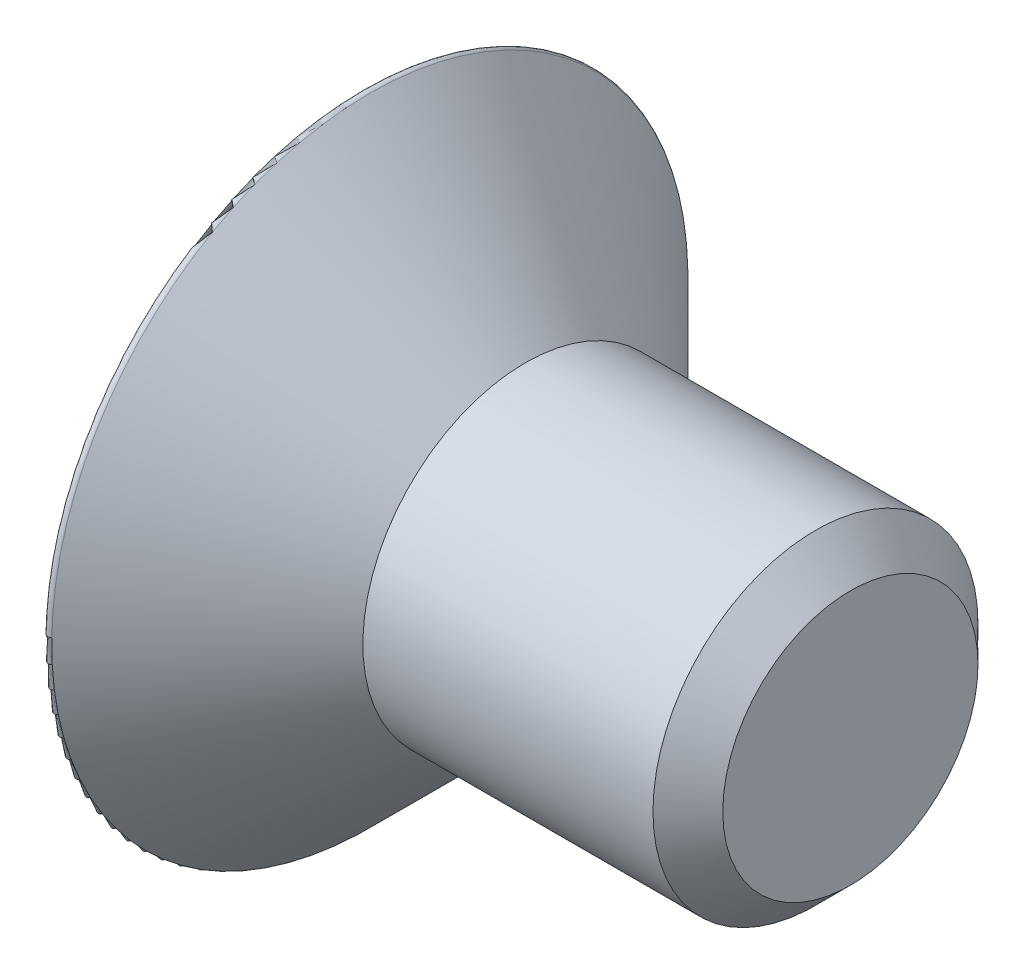
ISO-10303-21;
HEADER;
FILE_DESCRIPTION(('STEP AP214'),'2;1');
FILE_NAME('part.step','',(''),(''),'','','');
FILE_SCHEMA(('AUTOMOTIVE_DESIGN { 1 0 10303 214 1 1 1 1 }'));
ENDSEC;
DATA;
#1=APPLICATION_CONTEXT('core data for automotive mechanical design processes');
#2=APPLICATION_PROTOCOL_DEFINITION('international standard','automotive_design',2000,#1);
#3=PRODUCT_CONTEXT('',#1,'mechanical');
#4=PRODUCT('Part','Part','',(#3));
#5=PRODUCT_RELATED_PRODUCT_CATEGORY('part','',(#4));
#6=PRODUCT_DEFINITION_FORMATION('','',#4);
#7=PRODUCT_DEFINITION_CONTEXT('part definition',#1,'design');
#8=PRODUCT_DEFINITION('design','',#6,#7);
#9=PRODUCT_DEFINITION_SHAPE('','',#8);
#10=(LENGTH_UNIT() NAMED_UNIT(*) SI_UNIT(.MILLI.,.METRE.));
#11=(NAMED_UNIT(*) PLANE_ANGLE_UNIT() SI_UNIT($,.RADIAN.));
#12=(NAMED_UNIT(*) SI_UNIT($,.STERADIAN.) SOLID_ANGLE_UNIT());
#13=UNCERTAINTY_MEASURE_WITH_UNIT(LENGTH_MEASURE(1.E-05),#10,'distance_accuracy_value','');
#14=(GEOMETRIC_REPRESENTATION_CONTEXT(3) GLOBAL_UNCERTAINTY_ASSIGNED_CONTEXT((#13)) GLOBAL_UNIT_ASSIGNED_CONTEXT((#10,
#11,#12)) REPRESENTATION_CONTEXT('',''));
#15=CARTESIAN_POINT('',(0.,0.,0.));
#16=DIRECTION('',(0.,0.,1.));
#17=DIRECTION('',(1.,0.,0.));
#18=AXIS2_PLACEMENT_3D('',#15,#16,#17);
#19=CARTESIAN_POINT('',(1.15,0.,0.));
#20=DIRECTION('',(1.,0.,0.));
#21=DIRECTION('',(0.,0.,-1.));
#22=AXIS2_PLACEMENT_3D('',#19,#20,#21);
#23=PLANE('',#22);
#24=DIRECTION('',(0.,1.,0.));
#25=VECTOR('',#24,1.);
#26=CARTESIAN_POINT('',(1.15,0.72168783648703,1.25));
#27=LINE('',#26,#25);
#28=CARTESIAN_POINT('',(1.15,-0.72168783648703,1.25));
#29=VERTEX_POINT('',#28);
#30=CARTESIAN_POINT('',(1.15,0.72168783648703,1.25));
#31=VERTEX_POINT('',#30);
#32=EDGE_CURVE('E74',#29,#31,#27,.T.);
#33=ORIENTED_EDGE('',*,*,#32,.T.);
#34=DIRECTION('',(0.,-0.50000000000002,0.866025403784427));
#35=VECTOR('',#34,1.);
#36=CARTESIAN_POINT('',(1.15,1.4433756729741,0.));
#37=LINE('',#36,#35);
#38=CARTESIAN_POINT('',(1.15,1.4433756729741,0.));
#39=VERTEX_POINT('',#38);
#40=EDGE_CURVE('E105',#31,#39,#37,.F.);
#41=ORIENTED_EDGE('',*,*,#40,.T.);
#42=DIRECTION('',(0.,0.50000000000002,0.866025403784427));
#43=VECTOR('',#42,1.);
#44=CARTESIAN_POINT('',(1.15,0.72168783648703,-1.25));
#45=LINE('',#44,#43);
#46=CARTESIAN_POINT('',(1.15,0.72168783648703,-1.25));
#47=VERTEX_POINT('',#46);
#48=EDGE_CURVE('E100',#39,#47,#45,.F.);
#49=ORIENTED_EDGE('',*,*,#48,.T.);
#50=DIRECTION('',(0.,1.,0.));
#51=VECTOR('',#50,1.);
#52=CARTESIAN_POINT('',(1.15,-0.72168783648703,-1.25));
#53=LINE('',#52,#51);
#54=CARTESIAN_POINT('',(1.15,-0.72168783648703,-1.25));
#55=VERTEX_POINT('',#54);
#56=EDGE_CURVE('E96',#47,#55,#53,.F.);
#57=ORIENTED_EDGE('',*,*,#56,.T.);
#58=DIRECTION('',(0.,0.50000000000002,-0.866025403784427));
#59=VECTOR('',#58,1.);
#60=CARTESIAN_POINT('',(1.15,-1.4433756729741,0.));
#61=LINE('',#60,#59);
#62=CARTESIAN_POINT('',(1.15,-1.4433756729741,0.));
#63=VERTEX_POINT('',#62);
#64=EDGE_CURVE('E70',#55,#63,#61,.F.);
#65=ORIENTED_EDGE('',*,*,#64,.T.);
#66=DIRECTION('',(0.,-0.50000000000002,-0.866025403784427));
#67=VECTOR('',#66,1.);
#68=CARTESIAN_POINT('',(1.15,-0.72168783648703,1.25));
#69=LINE('',#68,#67);
#70=EDGE_CURVE('E72',#63,#29,#69,.F.);
#71=ORIENTED_EDGE('',*,*,#70,.T.);
#72=EDGE_LOOP('',(#33,#41,#49,#57,#65,#71));
#73=FACE_BOUND('',#72,.T.);
#74=ADVANCED_FACE('F19',(#73),#23,.F.);
#75=CARTESIAN_POINT('',(6.,0.,0.));
#76=DIRECTION('',(1.,0.,0.));
#77=DIRECTION('',(0.,0.,-1.));
#78=AXIS2_PLACEMENT_3D('',#75,#76,#77);
#79=PLANE('',#78);
#80=CARTESIAN_POINT('',(5.99999999991496,0.,0.));
#81=DIRECTION('',(-1.,0.,0.));
#82=DIRECTION('',(0.,0.,1.));
#83=AXIS2_PLACEMENT_3D('',#80,#81,#82);
#84=CIRCLE('',#83,1.57050000001391);
#85=CARTESIAN_POINT('',(5.99999999991496,0.,1.57050000001391));
#86=VERTEX_POINT('',#85);
#87=EDGE_CURVE('E22',#86,#86,#84,.T.);
#88=ORIENTED_EDGE('',*,*,#87,.F.);
#89=EDGE_LOOP('',(#88));
#90=FACE_BOUND('',#89,.T.);
#91=ADVANCED_FACE('F177',(#90),#79,.T.);
#92=CARTESIAN_POINT('',(0.,0.72168783648703,1.25));
#93=DIRECTION('',(0.,0.,1.));
#94=DIRECTION('',(1.,0.,0.));
#95=AXIS2_PLACEMENT_3D('',#92,#93,#94);
#96=PLANE('',#95);
#97=DIRECTION('',(1.,0.,0.));
#98=VECTOR('',#97,1.);
#99=CARTESIAN_POINT('',(0.,0.721687836487029,1.25));
#100=LINE('',#99,#98);
#101=CARTESIAN_POINT('',(0.,0.72168783648703,1.25));
#102=VERTEX_POINT('',#101);
#103=EDGE_CURVE('E85',#102,#31,#100,.T.);
#104=ORIENTED_EDGE('',*,*,#103,.T.);
#105=ORIENTED_EDGE('',*,*,#32,.F.);
#106=DIRECTION('',(1.,0.,0.));
#107=VECTOR('',#106,1.);
#108=CARTESIAN_POINT('',(0.,-0.72168783648703,1.25));
#109=LINE('',#108,#107);
#110=CARTESIAN_POINT('',(0.,-0.72168783648703,1.25));
#111=VERTEX_POINT('',#110);
#112=EDGE_CURVE('E79',#29,#111,#109,.F.);
#113=ORIENTED_EDGE('',*,*,#112,.T.);
#114=DIRECTION('',(0.,1.,0.));
#115=VECTOR('',#114,1.);
#116=CARTESIAN_POINT('',(0.,4.,1.25));
#117=LINE('',#116,#115);
#118=EDGE_CURVE('E198',#102,#111,#117,.F.);
#119=ORIENTED_EDGE('',*,*,#118,.F.);
#120=EDGE_LOOP('',(#104,#105,#113,#119));
#121=FACE_BOUND('',#120,.T.);
#122=ADVANCED_FACE('F82',(#121),#96,.F.);
#123=CARTESIAN_POINT('',(0.,-0.72168783648703,1.25));
#124=DIRECTION('',(0.,-0.866025403784427,0.50000000000002));
#125=DIRECTION('',(0.,-0.50000000000002,-0.866025403784427));
#126=AXIS2_PLACEMENT_3D('',#123,#124,#125);
#127=PLANE('',#126);
#128=ORIENTED_EDGE('',*,*,#112,.F.);
#129=ORIENTED_EDGE('',*,*,#70,.F.);
#130=DIRECTION('',(1.,0.,0.));
#131=VECTOR('',#130,1.);
#132=CARTESIAN_POINT('',(0.,-1.4433756729741,0.));
#133=LINE('',#132,#131);
#134=CARTESIAN_POINT('',(0.,-1.4433756729741,0.));
#135=VERTEX_POINT('',#134);
#136=EDGE_CURVE('E92',#63,#135,#133,.F.);
#137=ORIENTED_EDGE('',*,*,#136,.T.);
#138=DIRECTION('',(0.,-0.50000000000002,-0.866025403784427));
#139=VECTOR('',#138,1.);
#140=CARTESIAN_POINT('',(0.,-0.72168783648703,1.25));
#141=LINE('',#140,#139);
#142=EDGE_CURVE('E89',#111,#135,#141,.T.);
#143=ORIENTED_EDGE('',*,*,#142,.F.);
#144=EDGE_LOOP('',(#128,#129,#137,#143));
#145=FACE_BOUND('',#144,.T.);
#146=ADVANCED_FACE('F87',(#145),#127,.F.);
#147=CARTESIAN_POINT('',(0.,-1.4433756729741,0.));
#148=DIRECTION('',(0.,-0.866025403784427,-0.50000000000002));
#149=DIRECTION('',(0.,0.50000000000002,-0.866025403784427));
#150=AXIS2_PLACEMENT_3D('',#147,#148,#149);
#151=PLANE('',#150);
#152=ORIENTED_EDGE('',*,*,#136,.F.);
#153=ORIENTED_EDGE('',*,*,#64,.F.);
#154=DIRECTION('',(-1.,0.,0.));
#155=VECTOR('',#154,1.);
#156=CARTESIAN_POINT('',(0.,-0.72168783648703,-1.25));
#157=LINE('',#156,#155);
#158=CARTESIAN_POINT('',(0.,-0.72168783648703,-1.25));
#159=VERTEX_POINT('',#158);
#160=EDGE_CURVE('E98',#55,#159,#157,.T.);
#161=ORIENTED_EDGE('',*,*,#160,.T.);
#162=DIRECTION('',(0.,0.50000000000002,-0.866025403784427));
#163=VECTOR('',#162,1.);
#164=CARTESIAN_POINT('',(0.,-1.4433756729741,0.));
#165=LINE('',#164,#163);
#166=EDGE_CURVE('E200',#135,#159,#165,.T.);
#167=ORIENTED_EDGE('',*,*,#166,.F.);
#168=EDGE_LOOP('',(#152,#153,#161,#167));
#169=FACE_BOUND('',#168,.T.);
#170=ADVANCED_FACE('F169',(#169),#151,.F.);
#171=CARTESIAN_POINT('',(0.,-0.72168783648703,-1.25));
#172=DIRECTION('',(0.,0.,-1.));
#173=DIRECTION('',(-1.,0.,0.));
#174=AXIS2_PLACEMENT_3D('',#171,#172,#173);
#175=PLANE('',#174);
#176=ORIENTED_EDGE('',*,*,#160,.F.);
#177=ORIENTED_EDGE('',*,*,#56,.F.);
#178=DIRECTION('',(1.,0.,0.));
#179=VECTOR('',#178,1.);
#180=CARTESIAN_POINT('',(0.,0.72168783648703,-1.25));
#181=LINE('',#180,#179);
#182=CARTESIAN_POINT('',(0.,0.72168783648703,-1.25));
#183=VERTEX_POINT('',#182);
#184=EDGE_CURVE('E102',#47,#183,#181,.F.);
#185=ORIENTED_EDGE('',*,*,#184,.T.);
#186=DIRECTION('',(0.,1.,0.));
#187=VECTOR('',#186,1.);
#188=CARTESIAN_POINT('',(0.,4.,-1.25));
#189=LINE('',#188,#187);
#190=EDGE_CURVE('E205',#159,#183,#189,.T.);
#191=ORIENTED_EDGE('',*,*,#190,.F.);
#192=EDGE_LOOP('',(#176,#177,#185,#191));
#193=FACE_BOUND('',#192,.T.);
#194=ADVANCED_FACE('F166',(#193),#175,.F.);
#195=CARTESIAN_POINT('',(0.,0.72168783648703,-1.25));
#196=DIRECTION('',(0.,0.866025403784427,-0.50000000000002));
#197=DIRECTION('',(0.,0.50000000000002,0.866025403784427));
#198=AXIS2_PLACEMENT_3D('',#195,#196,#197);
#199=PLANE('',#198);
#200=ORIENTED_EDGE('',*,*,#184,.F.);
#201=ORIENTED_EDGE('',*,*,#48,.F.);
#202=DIRECTION('',(1.,0.,0.));
#203=VECTOR('',#202,1.);
#204=CARTESIAN_POINT('',(0.,1.4433756729741,0.));
#205=LINE('',#204,#203);
#206=CARTESIAN_POINT('',(0.,1.4433756729741,0.));
#207=VERTEX_POINT('',#206);
#208=EDGE_CURVE('E37',#39,#207,#205,.F.);
#209=ORIENTED_EDGE('',*,*,#208,.T.);
#210=DIRECTION('',(0.,0.50000000000002,0.866025403784427));
#211=VECTOR('',#210,1.);
#212=CARTESIAN_POINT('',(0.,0.72168783648703,-1.25));
#213=LINE('',#212,#211);
#214=EDGE_CURVE('E207',#183,#207,#213,.T.);
#215=ORIENTED_EDGE('',*,*,#214,.F.);
#216=EDGE_LOOP('',(#200,#201,#209,#215));
#217=FACE_BOUND('',#216,.T.);
#218=ADVANCED_FACE('F162',(#217),#199,.F.);
#219=CARTESIAN_POINT('',(0.,1.4433756729741,0.));
#220=DIRECTION('',(0.,0.866025403784427,0.50000000000002));
#221=DIRECTION('',(0.,-0.50000000000002,0.866025403784427));
#222=AXIS2_PLACEMENT_3D('',#219,#220,#221);
#223=PLANE('',#222);
#224=ORIENTED_EDGE('',*,*,#208,.F.);
#225=ORIENTED_EDGE('',*,*,#40,.F.);
#226=ORIENTED_EDGE('',*,*,#103,.F.);
#227=DIRECTION('',(0.,-0.50000000000002,0.866025403784427));
#228=VECTOR('',#227,1.);
#229=CARTESIAN_POINT('',(0.,1.4433756729741,0.));
#230=LINE('',#229,#228);
#231=EDGE_CURVE('E135',#207,#102,#230,.T.);
#232=ORIENTED_EDGE('',*,*,#231,.F.);
#233=EDGE_LOOP('',(#224,#225,#226,#232));
#234=FACE_BOUND('',#233,.T.);
#235=ADVANCED_FACE('F158',(#234),#223,.F.);
#236=CARTESIAN_POINT('',(5.57050000003301,0.,0.));
#237=DIRECTION('',(-1.,0.,0.));
#238=DIRECTION('',(0.,0.,1.));
#239=AXIS2_PLACEMENT_3D('',#236,#237,#238);
#240=CONICAL_SURFACE('',#239,1.99999999995271,0.785398163463622);
#241=CARTESIAN_POINT('',(5.5705,0.,0.));
#242=DIRECTION('',(1.,0.,0.));
#243=DIRECTION('',(0.,0.,-1.));
#244=AXIS2_PLACEMENT_3D('',#241,#242,#243);
#245=CIRCLE('',#244,2.);
#246=CARTESIAN_POINT('',(5.5705,0.,-2.));
#247=VERTEX_POINT('',#246);
#248=EDGE_CURVE('E131',#247,#247,#245,.F.);
#249=ORIENTED_EDGE('',*,*,#248,.F.);
#250=EDGE_LOOP('',(#249));
#251=FACE_BOUND('',#250,.T.);
#252=ORIENTED_EDGE('',*,*,#87,.T.);
#253=EDGE_LOOP('',(#252));
#254=FACE_BOUND('',#253,.T.);
#255=ADVANCED_FACE('F154',(#251,#254),#240,.T.);
#256=CARTESIAN_POINT('',(0.,4.,0.));
#257=DIRECTION('',(-1.,0.,0.));
#258=DIRECTION('',(0.,0.,1.));
#259=AXIS2_PLACEMENT_3D('',#256,#257,#258);
#260=PLANE('',#259);
#261=ORIENTED_EDGE('',*,*,#214,.T.);
#262=ORIENTED_EDGE('',*,*,#231,.T.);
#263=ORIENTED_EDGE('',*,*,#118,.T.);
#264=ORIENTED_EDGE('',*,*,#142,.T.);
#265=ORIENTED_EDGE('',*,*,#166,.T.);
#266=ORIENTED_EDGE('',*,*,#190,.T.);
#267=EDGE_LOOP('',(#261,#262,#263,#264,#265,#266));
#268=FACE_BOUND('',#267,.T.);
#269=CARTESIAN_POINT('',(0.,0.,0.));
#270=DIRECTION('',(1.,0.,0.));
#271=DIRECTION('',(0.,0.,1.));
#272=AXIS2_PLACEMENT_3D('',#269,#270,#271);
#273=CIRCLE('',#272,3.87928932188135);
#274=CARTESIAN_POINT('',(0.,0.,3.87928932188135));
#275=VERTEX_POINT('',#274);
#276=EDGE_CURVE('E134',#275,#275,#273,.T.);
#277=ORIENTED_EDGE('',*,*,#276,.F.);
#278=EDGE_LOOP('',(#277));
#279=FACE_BOUND('',#278,.T.);
#280=ADVANCED_FACE('F145',(#268,#279),#260,.T.);
#281=CARTESIAN_POINT('',(3.78525,0.,0.));
#282=DIRECTION('',(1.,0.,0.));
#283=DIRECTION('',(0.,0.,-1.));
#284=AXIS2_PLACEMENT_3D('',#281,#282,#283);
#285=CYLINDRICAL_SURFACE('',#284,2.);
#286=CARTESIAN_POINT('',(1.99999999989586,0.,0.));
#287=DIRECTION('',(-1.,0.,0.));
#288=DIRECTION('',(0.,1.,0.));
#289=AXIS2_PLACEMENT_3D('',#286,#287,#288);
#290=CIRCLE('',#289,1.99999999995271);
#291=CARTESIAN_POINT('',(1.99999999989586,1.99999999995271,0.));
#292=VERTEX_POINT('',#291);
#293=EDGE_CURVE('E28',#292,#292,#290,.T.);
#294=ORIENTED_EDGE('',*,*,#293,.F.);
#295=EDGE_LOOP('',(#294));
#296=FACE_BOUND('',#295,.T.);
#297=ORIENTED_EDGE('',*,*,#248,.T.);
#298=EDGE_LOOP('',(#297));
#299=FACE_BOUND('',#298,.T.);
#300=ADVANCED_FACE('F126',(#296,#299),#285,.T.);
#301=CARTESIAN_POINT('',(0.05,0.,0.));
#302=DIRECTION('',(1.,0.,0.));
#303=DIRECTION('',(0.,0.,-1.));
#304=AXIS2_PLACEMENT_3D('',#301,#302,#303);
#305=TOROIDAL_SURFACE('',#304,3.87928932188135,0.05);
#306=ORIENTED_EDGE('',*,*,#276,.T.);
#307=EDGE_LOOP('',(#306));
#308=FACE_BOUND('',#307,.T.);
#309=CARTESIAN_POINT('',(0.0853553389674744,0.,0.));
#310=DIRECTION('',(-1.,0.,0.));
#311=DIRECTION('',(0.,1.,0.));
#312=AXIS2_PLACEMENT_3D('',#309,#310,#311);
#313=CIRCLE('',#312,3.91464466088109);
#314=CARTESIAN_POINT('',(0.0853553389674744,3.91464466088109,0.));
#315=VERTEX_POINT('',#314);
#316=EDGE_CURVE('E11',#315,#315,#313,.F.);
#317=ORIENTED_EDGE('',*,*,#316,.F.);
#318=EDGE_LOOP('',(#317));
#319=FACE_BOUND('',#318,.T.);
#320=ADVANCED_FACE('F114',(#308,#319),#305,.T.);
#321=CARTESIAN_POINT('',(0.0853553389674744,0.,0.));
#322=DIRECTION('',(-1.,0.,0.));
#323=DIRECTION('',(0.,0.,1.));
#324=AXIS2_PLACEMENT_3D('',#321,#322,#323);
#325=CONICAL_SURFACE('',#324,3.91464466088109,0.785398163397448);
#326=ORIENTED_EDGE('',*,*,#316,.T.);
#327=EDGE_LOOP('',(#326));
#328=FACE_BOUND('',#327,.T.);
#329=ORIENTED_EDGE('',*,*,#293,.T.);
#330=EDGE_LOOP('',(#329));
#331=FACE_BOUND('',#330,.T.);
#332=ADVANCED_FACE('F125',(#328,#331),#325,.T.);
#333=CLOSED_SHELL('',(#74,#91,#122,#146,#170,#194,#218,#235,#255,#280,#300,#320,#332));
#334=MANIFOLD_SOLID_BREP('B1',#333);
#335=ADVANCED_BREP_SHAPE_REPRESENTATION('',(#18,#334),#14);
#336=SHAPE_DEFINITION_REPRESENTATION(#9,#335);
ENDSEC;
END-ISO-10303-21;
